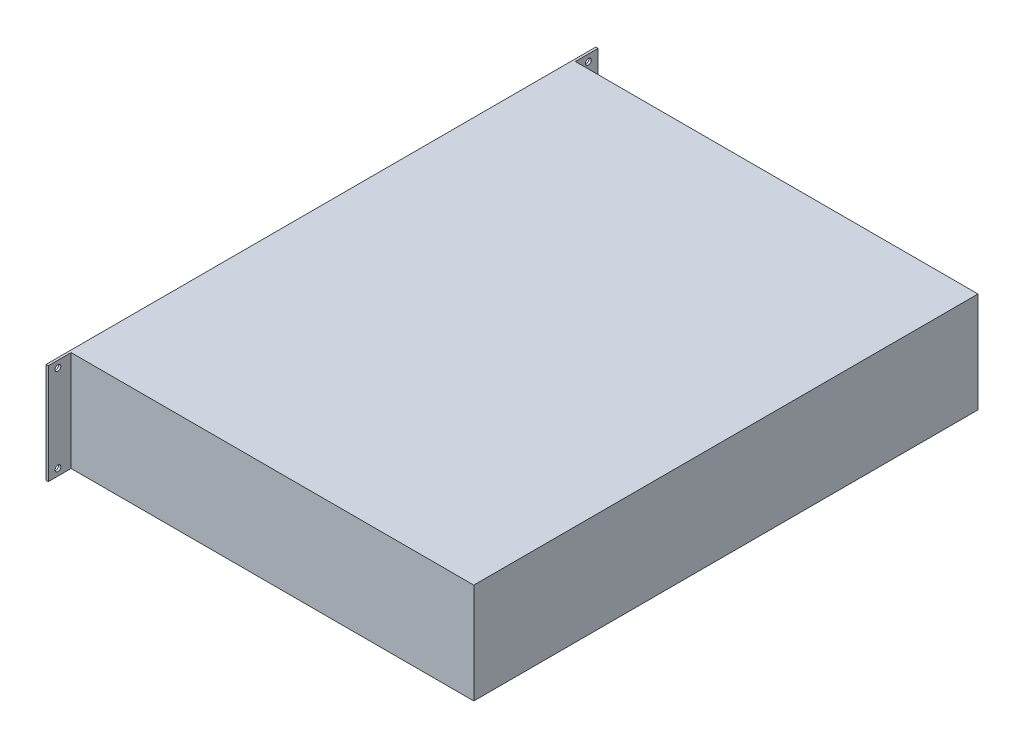
ISO-10303-21;
HEADER;
FILE_DESCRIPTION(('STEP AP214'),'2;1');
FILE_NAME('part.step','',(''),(''),'','','');
FILE_SCHEMA(('AUTOMOTIVE_DESIGN { 1 0 10303 214 1 1 1 1 }'));
ENDSEC;
DATA;
#1=APPLICATION_CONTEXT('core data for automotive mechanical design processes');
#2=APPLICATION_PROTOCOL_DEFINITION('international standard','automotive_design',2000,#1);
#3=PRODUCT_CONTEXT('',#1,'mechanical');
#4=PRODUCT('Part','Part','',(#3));
#5=PRODUCT_RELATED_PRODUCT_CATEGORY('part','',(#4));
#6=PRODUCT_DEFINITION_FORMATION('','',#4);
#7=PRODUCT_DEFINITION_CONTEXT('part definition',#1,'design');
#8=PRODUCT_DEFINITION('design','',#6,#7);
#9=PRODUCT_DEFINITION_SHAPE('','',#8);
#10=(LENGTH_UNIT() NAMED_UNIT(*) SI_UNIT(.MILLI.,.METRE.));
#11=(NAMED_UNIT(*) PLANE_ANGLE_UNIT() SI_UNIT($,.RADIAN.));
#12=(NAMED_UNIT(*) SI_UNIT($,.STERADIAN.) SOLID_ANGLE_UNIT());
#13=UNCERTAINTY_MEASURE_WITH_UNIT(LENGTH_MEASURE(1.E-05),#10,'distance_accuracy_value','');
#14=(GEOMETRIC_REPRESENTATION_CONTEXT(3) GLOBAL_UNCERTAINTY_ASSIGNED_CONTEXT((#13)) GLOBAL_UNIT_ASSIGNED_CONTEXT((#10,
#11,#12)) REPRESENTATION_CONTEXT('',''));
#15=CARTESIAN_POINT('',(0.,0.,0.));
#16=DIRECTION('',(0.,0.,1.));
#17=DIRECTION('',(1.,0.,0.));
#18=AXIS2_PLACEMENT_3D('',#15,#16,#17);
#19=CARTESIAN_POINT('',(-177.5,88.,-221.));
#20=DIRECTION('',(0.,0.,1.));
#21=DIRECTION('',(1.,0.,0.));
#22=AXIS2_PLACEMENT_3D('',#19,#20,#21);
#23=PLANE('',#22);
#24=DIRECTION('',(0.,-1.,0.));
#25=VECTOR('',#24,1.);
#26=CARTESIAN_POINT('',(-175.5,88.,-221.));
#27=LINE('',#26,#25);
#28=CARTESIAN_POINT('',(-175.5,88.,-221.));
#29=VERTEX_POINT('',#28);
#30=CARTESIAN_POINT('',(-175.5,0.,-221.));
#31=VERTEX_POINT('',#30);
#32=EDGE_CURVE('E168',#29,#31,#27,.T.);
#33=ORIENTED_EDGE('',*,*,#32,.F.);
#34=DIRECTION('',(-1.,0.,0.));
#35=VECTOR('',#34,1.);
#36=CARTESIAN_POINT('',(-177.5,88.,-221.));
#37=LINE('',#36,#35);
#38=CARTESIAN_POINT('',(177.5,88.,-221.));
#39=VERTEX_POINT('',#38);
#40=EDGE_CURVE('E176',#39,#29,#37,.T.);
#41=ORIENTED_EDGE('',*,*,#40,.F.);
#42=DIRECTION('',(0.,-1.,0.));
#43=VECTOR('',#42,1.);
#44=CARTESIAN_POINT('',(177.5,88.,-221.));
#45=LINE('',#44,#43);
#46=CARTESIAN_POINT('',(177.5,0.,-221.));
#47=VERTEX_POINT('',#46);
#48=EDGE_CURVE('E11',#39,#47,#45,.T.);
#49=ORIENTED_EDGE('',*,*,#48,.T.);
#50=DIRECTION('',(-1.,0.,0.));
#51=VECTOR('',#50,1.);
#52=CARTESIAN_POINT('',(-177.5,0.,-221.));
#53=LINE('',#52,#51);
#54=EDGE_CURVE('E188',#47,#31,#53,.T.);
#55=ORIENTED_EDGE('',*,*,#54,.T.);
#56=EDGE_LOOP('',(#33,#41,#49,#55));
#57=FACE_BOUND('',#56,.T.);
#58=ADVANCED_FACE('F43',(#57),#23,.F.);
#59=CARTESIAN_POINT('',(-177.5,88.,221.));
#60=DIRECTION('',(0.,0.,-1.));
#61=DIRECTION('',(-1.,0.,0.));
#62=AXIS2_PLACEMENT_3D('',#59,#60,#61);
#63=PLANE('',#62);
#64=DIRECTION('',(0.,1.,0.));
#65=VECTOR('',#64,1.);
#66=CARTESIAN_POINT('',(-175.5,88.,221.));
#67=LINE('',#66,#65);
#68=CARTESIAN_POINT('',(-175.5,0.,221.));
#69=VERTEX_POINT('',#68);
#70=CARTESIAN_POINT('',(-175.5,88.,221.));
#71=VERTEX_POINT('',#70);
#72=EDGE_CURVE('E65',#69,#71,#67,.T.);
#73=ORIENTED_EDGE('',*,*,#72,.F.);
#74=DIRECTION('',(1.,0.,0.));
#75=VECTOR('',#74,1.);
#76=CARTESIAN_POINT('',(-177.5,0.,221.));
#77=LINE('',#76,#75);
#78=CARTESIAN_POINT('',(177.5,0.,221.));
#79=VERTEX_POINT('',#78);
#80=EDGE_CURVE('E177',#69,#79,#77,.T.);
#81=ORIENTED_EDGE('',*,*,#80,.T.);
#82=DIRECTION('',(0.,-1.,0.));
#83=VECTOR('',#82,1.);
#84=CARTESIAN_POINT('',(177.5,88.,221.));
#85=LINE('',#84,#83);
#86=CARTESIAN_POINT('',(177.5,88.,221.));
#87=VERTEX_POINT('',#86);
#88=EDGE_CURVE('E52',#87,#79,#85,.T.);
#89=ORIENTED_EDGE('',*,*,#88,.F.);
#90=DIRECTION('',(1.,0.,0.));
#91=VECTOR('',#90,1.);
#92=CARTESIAN_POINT('',(-177.5,88.,221.));
#93=LINE('',#92,#91);
#94=EDGE_CURVE('E61',#71,#87,#93,.T.);
#95=ORIENTED_EDGE('',*,*,#94,.F.);
#96=EDGE_LOOP('',(#73,#81,#89,#95));
#97=FACE_BOUND('',#96,.T.);
#98=ADVANCED_FACE('F229',(#97),#63,.F.);
#99=CARTESIAN_POINT('',(177.5,88.,-221.));
#100=DIRECTION('',(-1.,0.,0.));
#101=DIRECTION('',(0.,0.,1.));
#102=AXIS2_PLACEMENT_3D('',#99,#100,#101);
#103=PLANE('',#102);
#104=DIRECTION('',(0.,0.,-1.));
#105=VECTOR('',#104,1.);
#106=CARTESIAN_POINT('',(177.5,0.,-221.));
#107=LINE('',#106,#105);
#108=EDGE_CURVE('E171',#79,#47,#107,.T.);
#109=ORIENTED_EDGE('',*,*,#108,.T.);
#110=ORIENTED_EDGE('',*,*,#48,.F.);
#111=DIRECTION('',(0.,0.,-1.));
#112=VECTOR('',#111,1.);
#113=CARTESIAN_POINT('',(177.5,88.,-221.));
#114=LINE('',#113,#112);
#115=EDGE_CURVE('E172',#87,#39,#114,.T.);
#116=ORIENTED_EDGE('',*,*,#115,.F.);
#117=ORIENTED_EDGE('',*,*,#88,.T.);
#118=EDGE_LOOP('',(#109,#110,#116,#117));
#119=FACE_BOUND('',#118,.T.);
#120=ADVANCED_FACE('F45',(#119),#103,.F.);
#121=CARTESIAN_POINT('',(-177.5,88.,-221.));
#122=DIRECTION('',(1.,0.,0.));
#123=DIRECTION('',(0.,0.,-1.));
#124=AXIS2_PLACEMENT_3D('',#121,#122,#123);
#125=PLANE('',#124);
#126=DIRECTION('',(0.,0.,1.));
#127=VECTOR('',#126,1.);
#128=CARTESIAN_POINT('',(-177.5,0.,-221.));
#129=LINE('',#128,#127);
#130=CARTESIAN_POINT('',(-177.5,0.,-241.));
#131=VERTEX_POINT('',#130);
#132=CARTESIAN_POINT('',(-177.5,0.,241.));
#133=VERTEX_POINT('',#132);
#134=EDGE_CURVE('E192',#131,#133,#129,.T.);
#135=ORIENTED_EDGE('',*,*,#134,.T.);
#136=DIRECTION('',(0.,1.,0.));
#137=VECTOR('',#136,1.);
#138=CARTESIAN_POINT('',(-177.5,88.,241.));
#139=LINE('',#138,#137);
#140=CARTESIAN_POINT('',(-177.5,88.,241.));
#141=VERTEX_POINT('',#140);
#142=EDGE_CURVE('E142',#133,#141,#139,.T.);
#143=ORIENTED_EDGE('',*,*,#142,.T.);
#144=DIRECTION('',(0.,0.,1.));
#145=VECTOR('',#144,1.);
#146=CARTESIAN_POINT('',(-177.5,88.,-221.));
#147=LINE('',#146,#145);
#148=CARTESIAN_POINT('',(-177.5,88.,-241.));
#149=VERTEX_POINT('',#148);
#150=EDGE_CURVE('E114',#149,#141,#147,.T.);
#151=ORIENTED_EDGE('',*,*,#150,.F.);
#152=DIRECTION('',(0.,-1.,0.));
#153=VECTOR('',#152,1.);
#154=CARTESIAN_POINT('',(-177.5,88.,-241.));
#155=LINE('',#154,#153);
#156=EDGE_CURVE('E137',#149,#131,#155,.T.);
#157=ORIENTED_EDGE('',*,*,#156,.T.);
#158=EDGE_LOOP('',(#135,#143,#151,#157));
#159=FACE_BOUND('',#158,.T.);
#160=CARTESIAN_POINT('',(-177.5,82.1,232.5));
#161=DIRECTION('',(-1.,0.,0.));
#162=DIRECTION('',(0.,0.,1.));
#163=AXIS2_PLACEMENT_3D('',#160,#161,#162);
#164=CIRCLE('',#163,2.5);
#165=CARTESIAN_POINT('',(-177.5,82.1,235.));
#166=VERTEX_POINT('',#165);
#167=EDGE_CURVE('E145',#166,#166,#164,.T.);
#168=ORIENTED_EDGE('',*,*,#167,.F.);
#169=EDGE_LOOP('',(#168));
#170=FACE_BOUND('',#169,.T.);
#171=CARTESIAN_POINT('',(-177.5,5.89999999999999,232.5));
#172=DIRECTION('',(-1.,0.,0.));
#173=DIRECTION('',(0.,0.,-1.));
#174=AXIS2_PLACEMENT_3D('',#171,#172,#173);
#175=CIRCLE('',#174,2.5);
#176=CARTESIAN_POINT('',(-177.5,5.89999999999999,230.));
#177=VERTEX_POINT('',#176);
#178=EDGE_CURVE('E282',#177,#177,#175,.T.);
#179=ORIENTED_EDGE('',*,*,#178,.F.);
#180=EDGE_LOOP('',(#179));
#181=FACE_BOUND('',#180,.T.);
#182=CARTESIAN_POINT('',(-177.5,5.89999999999999,-232.5));
#183=DIRECTION('',(-1.,0.,0.));
#184=DIRECTION('',(0.,0.,1.));
#185=AXIS2_PLACEMENT_3D('',#182,#183,#184);
#186=CIRCLE('',#185,2.5);
#187=CARTESIAN_POINT('',(-177.5,5.89999999999999,-230.));
#188=VERTEX_POINT('',#187);
#189=EDGE_CURVE('E275',#188,#188,#186,.T.);
#190=ORIENTED_EDGE('',*,*,#189,.F.);
#191=EDGE_LOOP('',(#190));
#192=FACE_BOUND('',#191,.T.);
#193=CARTESIAN_POINT('',(-177.5,82.1,-232.5));
#194=DIRECTION('',(-1.,0.,0.));
#195=DIRECTION('',(0.,0.,-1.));
#196=AXIS2_PLACEMENT_3D('',#193,#194,#195);
#197=CIRCLE('',#196,2.5);
#198=CARTESIAN_POINT('',(-177.5,82.1,-235.));
#199=VERTEX_POINT('',#198);
#200=EDGE_CURVE('E270',#199,#199,#197,.T.);
#201=ORIENTED_EDGE('',*,*,#200,.F.);
#202=EDGE_LOOP('',(#201));
#203=FACE_BOUND('',#202,.T.);
#204=ADVANCED_FACE('F235',(#159,#170,#181,#192,#203),#125,.F.);
#205=CARTESIAN_POINT('',(0.,88.,0.));
#206=DIRECTION('',(0.,1.,0.));
#207=DIRECTION('',(0.,0.,1.));
#208=AXIS2_PLACEMENT_3D('',#205,#206,#207);
#209=PLANE('',#208);
#210=ORIENTED_EDGE('',*,*,#150,.T.);
#211=DIRECTION('',(-1.,0.,0.));
#212=VECTOR('',#211,1.);
#213=CARTESIAN_POINT('',(-175.5,88.,241.));
#214=LINE('',#213,#212);
#215=CARTESIAN_POINT('',(-175.5,88.,241.));
#216=VERTEX_POINT('',#215);
#217=EDGE_CURVE('E109',#216,#141,#214,.T.);
#218=ORIENTED_EDGE('',*,*,#217,.F.);
#219=DIRECTION('',(0.,0.,-1.));
#220=VECTOR('',#219,1.);
#221=CARTESIAN_POINT('',(-175.5,88.,-241.));
#222=LINE('',#221,#220);
#223=EDGE_CURVE('E112',#216,#71,#222,.T.);
#224=ORIENTED_EDGE('',*,*,#223,.T.);
#225=ORIENTED_EDGE('',*,*,#94,.T.);
#226=ORIENTED_EDGE('',*,*,#115,.T.);
#227=ORIENTED_EDGE('',*,*,#40,.T.);
#228=CARTESIAN_POINT('',(-175.5,88.,-241.));
#229=VERTEX_POINT('',#228);
#230=EDGE_CURVE('E130',#29,#229,#222,.T.);
#231=ORIENTED_EDGE('',*,*,#230,.T.);
#232=DIRECTION('',(-1.,0.,0.));
#233=VECTOR('',#232,1.);
#234=CARTESIAN_POINT('',(-175.5,88.,-241.));
#235=LINE('',#234,#233);
#236=EDGE_CURVE('E120',#229,#149,#235,.T.);
#237=ORIENTED_EDGE('',*,*,#236,.T.);
#238=EDGE_LOOP('',(#210,#218,#224,#225,#226,#227,#231,#237));
#239=FACE_BOUND('',#238,.T.);
#240=ADVANCED_FACE('F111',(#239),#209,.T.);
#241=CARTESIAN_POINT('',(0.,0.,0.));
#242=DIRECTION('',(0.,1.,0.));
#243=DIRECTION('',(0.,0.,1.));
#244=AXIS2_PLACEMENT_3D('',#241,#242,#243);
#245=PLANE('',#244);
#246=ORIENTED_EDGE('',*,*,#134,.F.);
#247=DIRECTION('',(-1.,0.,0.));
#248=VECTOR('',#247,1.);
#249=CARTESIAN_POINT('',(-175.5,0.,-241.));
#250=LINE('',#249,#248);
#251=CARTESIAN_POINT('',(-175.5,0.,-241.));
#252=VERTEX_POINT('',#251);
#253=EDGE_CURVE('E160',#252,#131,#250,.T.);
#254=ORIENTED_EDGE('',*,*,#253,.F.);
#255=DIRECTION('',(0.,0.,1.));
#256=VECTOR('',#255,1.);
#257=CARTESIAN_POINT('',(-175.5,0.,-241.));
#258=LINE('',#257,#256);
#259=EDGE_CURVE('E121',#252,#31,#258,.T.);
#260=ORIENTED_EDGE('',*,*,#259,.T.);
#261=ORIENTED_EDGE('',*,*,#54,.F.);
#262=ORIENTED_EDGE('',*,*,#108,.F.);
#263=ORIENTED_EDGE('',*,*,#80,.F.);
#264=CARTESIAN_POINT('',(-175.5,0.,241.));
#265=VERTEX_POINT('',#264);
#266=EDGE_CURVE('E151',#69,#265,#258,.T.);
#267=ORIENTED_EDGE('',*,*,#266,.T.);
#268=DIRECTION('',(-1.,0.,0.));
#269=VECTOR('',#268,1.);
#270=CARTESIAN_POINT('',(-175.5,0.,241.));
#271=LINE('',#270,#269);
#272=EDGE_CURVE('E135',#265,#133,#271,.T.);
#273=ORIENTED_EDGE('',*,*,#272,.T.);
#274=EDGE_LOOP('',(#246,#254,#260,#261,#262,#263,#267,#273));
#275=FACE_BOUND('',#274,.T.);
#276=ADVANCED_FACE('F203',(#275),#245,.F.);
#277=CARTESIAN_POINT('',(-175.5,88.,241.));
#278=DIRECTION('',(0.,0.,1.));
#279=DIRECTION('',(1.,0.,0.));
#280=AXIS2_PLACEMENT_3D('',#277,#278,#279);
#281=PLANE('',#280);
#282=ORIENTED_EDGE('',*,*,#142,.F.);
#283=ORIENTED_EDGE('',*,*,#272,.F.);
#284=DIRECTION('',(0.,1.,0.));
#285=VECTOR('',#284,1.);
#286=CARTESIAN_POINT('',(-175.5,88.,241.));
#287=LINE('',#286,#285);
#288=EDGE_CURVE('E127',#265,#216,#287,.T.);
#289=ORIENTED_EDGE('',*,*,#288,.T.);
#290=ORIENTED_EDGE('',*,*,#217,.T.);
#291=EDGE_LOOP('',(#282,#283,#289,#290));
#292=FACE_BOUND('',#291,.T.);
#293=ADVANCED_FACE('F133',(#292),#281,.T.);
#294=CARTESIAN_POINT('',(-175.5,5.89999999999999,232.5));
#295=DIRECTION('',(-1.,0.,0.));
#296=DIRECTION('',(0.,0.,1.));
#297=AXIS2_PLACEMENT_3D('',#294,#295,#296);
#298=CYLINDRICAL_SURFACE('',#297,2.5);
#299=CARTESIAN_POINT('',(-175.5,5.89999999999999,232.5));
#300=DIRECTION('',(-1.,0.,0.));
#301=DIRECTION('',(0.,0.,-1.));
#302=AXIS2_PLACEMENT_3D('',#299,#300,#301);
#303=CIRCLE('',#302,2.5);
#304=CARTESIAN_POINT('',(-175.5,5.89999999999999,230.));
#305=VERTEX_POINT('',#304);
#306=EDGE_CURVE('E286',#305,#305,#303,.T.);
#307=ORIENTED_EDGE('',*,*,#306,.F.);
#308=EDGE_LOOP('',(#307));
#309=FACE_BOUND('',#308,.T.);
#310=ORIENTED_EDGE('',*,*,#178,.T.);
#311=EDGE_LOOP('',(#310));
#312=FACE_BOUND('',#311,.T.);
#313=ADVANCED_FACE('F244',(#309,#312),#298,.F.);
#314=CARTESIAN_POINT('',(-175.5,82.1,232.5));
#315=DIRECTION('',(-1.,0.,0.));
#316=DIRECTION('',(0.,0.,1.));
#317=AXIS2_PLACEMENT_3D('',#314,#315,#316);
#318=CYLINDRICAL_SURFACE('',#317,2.5);
#319=CARTESIAN_POINT('',(-175.5,82.1,232.5));
#320=DIRECTION('',(-1.,0.,0.));
#321=DIRECTION('',(0.,0.,1.));
#322=AXIS2_PLACEMENT_3D('',#319,#320,#321);
#323=CIRCLE('',#322,2.5);
#324=CARTESIAN_POINT('',(-175.5,82.1,235.));
#325=VERTEX_POINT('',#324);
#326=EDGE_CURVE('E156',#325,#325,#323,.T.);
#327=ORIENTED_EDGE('',*,*,#326,.F.);
#328=EDGE_LOOP('',(#327));
#329=FACE_BOUND('',#328,.T.);
#330=ORIENTED_EDGE('',*,*,#167,.T.);
#331=EDGE_LOOP('',(#330));
#332=FACE_BOUND('',#331,.T.);
#333=ADVANCED_FACE('F223',(#329,#332),#318,.F.);
#334=CARTESIAN_POINT('',(-175.5,0.,0.));
#335=DIRECTION('',(-1.,0.,0.));
#336=DIRECTION('',(0.,0.,1.));
#337=AXIS2_PLACEMENT_3D('',#334,#335,#336);
#338=PLANE('',#337);
#339=ORIENTED_EDGE('',*,*,#326,.T.);
#340=EDGE_LOOP('',(#339));
#341=FACE_BOUND('',#340,.T.);
#342=ORIENTED_EDGE('',*,*,#306,.T.);
#343=EDGE_LOOP('',(#342));
#344=FACE_BOUND('',#343,.T.);
#345=ORIENTED_EDGE('',*,*,#266,.F.);
#346=ORIENTED_EDGE('',*,*,#72,.T.);
#347=ORIENTED_EDGE('',*,*,#223,.F.);
#348=ORIENTED_EDGE('',*,*,#288,.F.);
#349=EDGE_LOOP('',(#345,#346,#347,#348));
#350=FACE_BOUND('',#349,.T.);
#351=ADVANCED_FACE('F126',(#341,#344,#350),#338,.F.);
#352=CARTESIAN_POINT('',(-175.5,82.1,-232.5));
#353=DIRECTION('',(-1.,0.,0.));
#354=DIRECTION('',(0.,0.,-1.));
#355=AXIS2_PLACEMENT_3D('',#352,#353,#354);
#356=CIRCLE('',#355,2.5);
#357=CARTESIAN_POINT('',(-175.5,82.1,-235.));
#358=VERTEX_POINT('',#357);
#359=EDGE_CURVE('E267',#358,#358,#356,.T.);
#360=ORIENTED_EDGE('',*,*,#359,.T.);
#361=EDGE_LOOP('',(#360));
#362=FACE_BOUND('',#361,.T.);
#363=CARTESIAN_POINT('',(-175.5,5.89999999999999,-232.5));
#364=DIRECTION('',(-1.,0.,0.));
#365=DIRECTION('',(0.,0.,1.));
#366=AXIS2_PLACEMENT_3D('',#363,#364,#365);
#367=CIRCLE('',#366,2.5);
#368=CARTESIAN_POINT('',(-175.5,5.89999999999999,-230.));
#369=VERTEX_POINT('',#368);
#370=EDGE_CURVE('E278',#369,#369,#367,.T.);
#371=ORIENTED_EDGE('',*,*,#370,.T.);
#372=EDGE_LOOP('',(#371));
#373=FACE_BOUND('',#372,.T.);
#374=ORIENTED_EDGE('',*,*,#230,.F.);
#375=ORIENTED_EDGE('',*,*,#32,.T.);
#376=ORIENTED_EDGE('',*,*,#259,.F.);
#377=DIRECTION('',(0.,-1.,0.));
#378=VECTOR('',#377,1.);
#379=CARTESIAN_POINT('',(-175.5,88.,-241.));
#380=LINE('',#379,#378);
#381=EDGE_CURVE('E129',#229,#252,#380,.T.);
#382=ORIENTED_EDGE('',*,*,#381,.F.);
#383=EDGE_LOOP('',(#374,#375,#376,#382));
#384=FACE_BOUND('',#383,.T.);
#385=ADVANCED_FACE('F213',(#362,#373,#384),#338,.F.);
#386=CARTESIAN_POINT('',(-175.5,88.,-241.));
#387=DIRECTION('',(0.,0.,-1.));
#388=DIRECTION('',(-1.,0.,0.));
#389=AXIS2_PLACEMENT_3D('',#386,#387,#388);
#390=PLANE('',#389);
#391=ORIENTED_EDGE('',*,*,#156,.F.);
#392=ORIENTED_EDGE('',*,*,#236,.F.);
#393=ORIENTED_EDGE('',*,*,#381,.T.);
#394=ORIENTED_EDGE('',*,*,#253,.T.);
#395=EDGE_LOOP('',(#391,#392,#393,#394));
#396=FACE_BOUND('',#395,.T.);
#397=ADVANCED_FACE('F212',(#396),#390,.T.);
#398=CARTESIAN_POINT('',(-175.5,5.89999999999999,-232.5));
#399=DIRECTION('',(-1.,0.,0.));
#400=DIRECTION('',(0.,0.,1.));
#401=AXIS2_PLACEMENT_3D('',#398,#399,#400);
#402=CYLINDRICAL_SURFACE('',#401,2.5);
#403=ORIENTED_EDGE('',*,*,#370,.F.);
#404=EDGE_LOOP('',(#403));
#405=FACE_BOUND('',#404,.T.);
#406=ORIENTED_EDGE('',*,*,#189,.T.);
#407=EDGE_LOOP('',(#406));
#408=FACE_BOUND('',#407,.T.);
#409=ADVANCED_FACE('F221',(#405,#408),#402,.F.);
#410=CARTESIAN_POINT('',(-175.5,82.1,-232.5));
#411=DIRECTION('',(-1.,0.,0.));
#412=DIRECTION('',(0.,0.,1.));
#413=AXIS2_PLACEMENT_3D('',#410,#411,#412);
#414=CYLINDRICAL_SURFACE('',#413,2.5);
#415=ORIENTED_EDGE('',*,*,#359,.F.);
#416=EDGE_LOOP('',(#415));
#417=FACE_BOUND('',#416,.T.);
#418=ORIENTED_EDGE('',*,*,#200,.T.);
#419=EDGE_LOOP('',(#418));
#420=FACE_BOUND('',#419,.T.);
#421=ADVANCED_FACE('F259',(#417,#420),#414,.F.);
#422=CLOSED_SHELL('',(#58,#98,#120,#204,#240,#276,#293,#313,#333,#351,#385,#397,#409,#421));
#423=MANIFOLD_SOLID_BREP('B2',#422);
#424=ADVANCED_BREP_SHAPE_REPRESENTATION('',(#18,#423),#14);
#425=SHAPE_DEFINITION_REPRESENTATION(#9,#424);
ENDSEC;
END-ISO-10303-21;
